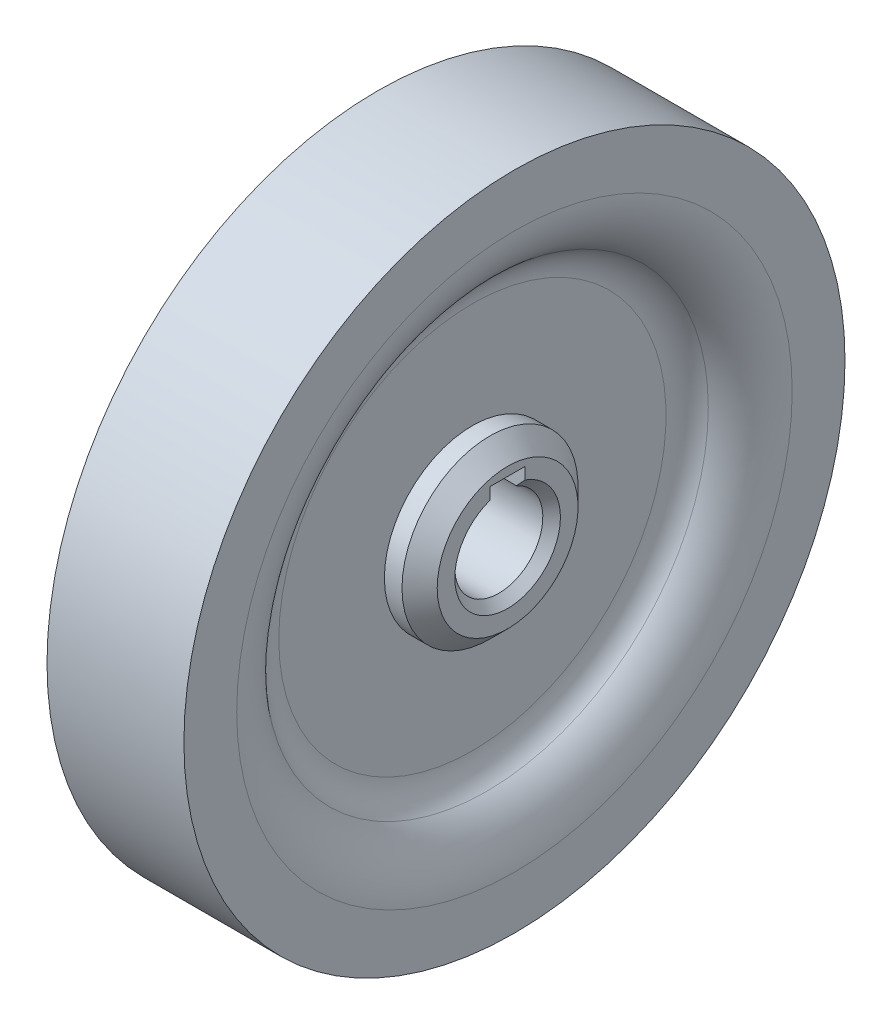
ISO-10303-21;
HEADER;
FILE_DESCRIPTION(('STEP AP214'),'2;1');
FILE_NAME('part.step','',(''),(''),'','','');
FILE_SCHEMA(('AUTOMOTIVE_DESIGN { 1 0 10303 214 1 1 1 1 }'));
ENDSEC;
DATA;
#1=APPLICATION_CONTEXT('core data for automotive mechanical design processes');
#2=APPLICATION_PROTOCOL_DEFINITION('international standard','automotive_design',2000,#1);
#3=PRODUCT_CONTEXT('',#1,'mechanical');
#4=PRODUCT('Part','Part','',(#3));
#5=PRODUCT_RELATED_PRODUCT_CATEGORY('part','',(#4));
#6=PRODUCT_DEFINITION_FORMATION('','',#4);
#7=PRODUCT_DEFINITION_CONTEXT('part definition',#1,'design');
#8=PRODUCT_DEFINITION('design','',#6,#7);
#9=PRODUCT_DEFINITION_SHAPE('','',#8);
#10=(LENGTH_UNIT() NAMED_UNIT(*) SI_UNIT(.MILLI.,.METRE.));
#11=(NAMED_UNIT(*) PLANE_ANGLE_UNIT() SI_UNIT($,.RADIAN.));
#12=(NAMED_UNIT(*) SI_UNIT($,.STERADIAN.) SOLID_ANGLE_UNIT());
#13=UNCERTAINTY_MEASURE_WITH_UNIT(LENGTH_MEASURE(1.E-05),#10,'distance_accuracy_value','');
#14=(GEOMETRIC_REPRESENTATION_CONTEXT(3) GLOBAL_UNCERTAINTY_ASSIGNED_CONTEXT((#13)) GLOBAL_UNIT_ASSIGNED_CONTEXT((#10,
#11,#12)) REPRESENTATION_CONTEXT('',''));
#15=CARTESIAN_POINT('',(0.,0.,0.));
#16=DIRECTION('',(0.,0.,1.));
#17=DIRECTION('',(1.,0.,0.));
#18=AXIS2_PLACEMENT_3D('',#15,#16,#17);
#19=CARTESIAN_POINT('',(-1.77338341008022,0.,0.));
#20=DIRECTION('',(-1.,0.,0.));
#21=DIRECTION('',(0.,0.,1.));
#22=AXIS2_PLACEMENT_3D('',#19,#20,#21);
#23=CYLINDRICAL_SURFACE('',#22,37.555066430944);
#24=CARTESIAN_POINT('',(-7.77753321547199,0.,0.));
#25=DIRECTION('',(-1.,0.,0.));
#26=DIRECTION('',(0.,0.,1.));
#27=AXIS2_PLACEMENT_3D('',#24,#25,#26);
#28=CIRCLE('',#27,37.555066430944);
#29=CARTESIAN_POINT('',(-7.77753321547199,0.,37.555066430944));
#30=VERTEX_POINT('',#29);
#31=EDGE_CURVE('E249',#30,#30,#28,.T.);
#32=ORIENTED_EDGE('',*,*,#31,.F.);
#33=EDGE_LOOP('',(#32));
#34=FACE_BOUND('',#33,.T.);
#35=CARTESIAN_POINT('',(7.77753321547199,0.,0.));
#36=DIRECTION('',(-1.,0.,0.));
#37=DIRECTION('',(0.,0.,1.));
#38=AXIS2_PLACEMENT_3D('',#35,#36,#37);
#39=CIRCLE('',#38,37.555066430944);
#40=CARTESIAN_POINT('',(7.77753321547199,0.,37.555066430944));
#41=VERTEX_POINT('',#40);
#42=EDGE_CURVE('E213',#41,#41,#39,.T.);
#43=ORIENTED_EDGE('',*,*,#42,.T.);
#44=EDGE_LOOP('',(#43));
#45=FACE_BOUND('',#44,.T.);
#46=ADVANCED_FACE('F45',(#34,#45),#23,.T.);
#47=CARTESIAN_POINT('',(7.77753321547199,37.555066430944,0.));
#48=DIRECTION('',(-1.,0.,0.));
#49=DIRECTION('',(0.,0.,1.));
#50=AXIS2_PLACEMENT_3D('',#47,#48,#49);
#51=PLANE('',#50);
#52=ORIENTED_EDGE('',*,*,#42,.F.);
#53=EDGE_LOOP('',(#52));
#54=FACE_BOUND('',#53,.T.);
#55=CARTESIAN_POINT('',(7.77753321547199,0.,0.));
#56=DIRECTION('',(-1.,0.,0.));
#57=DIRECTION('',(0.,0.,1.));
#58=AXIS2_PLACEMENT_3D('',#55,#56,#57);
#59=CIRCLE('',#58,31.555066430944);
#60=CARTESIAN_POINT('',(7.77753321547199,0.,31.555066430944));
#61=VERTEX_POINT('',#60);
#62=EDGE_CURVE('E217',#61,#61,#59,.T.);
#63=ORIENTED_EDGE('',*,*,#62,.T.);
#64=EDGE_LOOP('',(#63));
#65=FACE_BOUND('',#64,.T.);
#66=ADVANCED_FACE('F268',(#54,#65),#51,.F.);
#67=CARTESIAN_POINT('',(-0.166299823207954,0.,0.));
#68=DIRECTION('',(-1.,0.,0.));
#69=DIRECTION('',(0.,0.,1.));
#70=AXIS2_PLACEMENT_3D('',#67,#68,#69);
#71=TOROIDAL_SURFACE('',#70,31.555066430944,7.94383303867995);
#72=ORIENTED_EDGE('',*,*,#62,.F.);
#73=EDGE_LOOP('',(#72));
#74=FACE_BOUND('',#73,.T.);
#75=CARTESIAN_POINT('',(4.60000000000001,0.,0.));
#76=DIRECTION('',(-1.,0.,0.));
#77=DIRECTION('',(0.,0.,1.));
#78=AXIS2_PLACEMENT_3D('',#75,#76,#77);
#79=CIRCLE('',#78,25.2);
#80=CARTESIAN_POINT('',(4.60000000000001,0.,25.2));
#81=VERTEX_POINT('',#80);
#82=EDGE_CURVE('E221',#81,#81,#79,.T.);
#83=ORIENTED_EDGE('',*,*,#82,.T.);
#84=EDGE_LOOP('',(#83));
#85=FACE_BOUND('',#84,.T.);
#86=ADVANCED_FACE('F274',(#74,#85),#71,.T.);
#87=CARTESIAN_POINT('',(7.,0.,0.));
#88=DIRECTION('',(-1.,0.,0.));
#89=DIRECTION('',(0.,0.,1.));
#90=AXIS2_PLACEMENT_3D('',#87,#88,#89);
#91=TOROIDAL_SURFACE('',#90,22.,4.);
#92=ORIENTED_EDGE('',*,*,#82,.F.);
#93=EDGE_LOOP('',(#92));
#94=FACE_BOUND('',#93,.T.);
#95=CARTESIAN_POINT('',(3.,0.,0.));
#96=DIRECTION('',(-1.,0.,0.));
#97=DIRECTION('',(0.,0.,1.));
#98=AXIS2_PLACEMENT_3D('',#95,#96,#97);
#99=CIRCLE('',#98,22.);
#100=CARTESIAN_POINT('',(3.,0.,22.));
#101=VERTEX_POINT('',#100);
#102=EDGE_CURVE('E225',#101,#101,#99,.T.);
#103=ORIENTED_EDGE('',*,*,#102,.T.);
#104=EDGE_LOOP('',(#103));
#105=FACE_BOUND('',#104,.T.);
#106=ADVANCED_FACE('F319',(#94,#105),#91,.F.);
#107=CARTESIAN_POINT('',(3.,22.,0.));
#108=DIRECTION('',(-1.,0.,0.));
#109=DIRECTION('',(0.,0.,1.));
#110=AXIS2_PLACEMENT_3D('',#107,#108,#109);
#111=PLANE('',#110);
#112=ORIENTED_EDGE('',*,*,#102,.F.);
#113=EDGE_LOOP('',(#112));
#114=FACE_BOUND('',#113,.T.);
#115=CARTESIAN_POINT('',(3.,0.,0.));
#116=DIRECTION('',(-1.,0.,0.));
#117=DIRECTION('',(0.,0.,1.));
#118=AXIS2_PLACEMENT_3D('',#115,#116,#117);
#119=CIRCLE('',#118,10.);
#120=CARTESIAN_POINT('',(3.,0.,10.));
#121=VERTEX_POINT('',#120);
#122=EDGE_CURVE('E229',#121,#121,#119,.T.);
#123=ORIENTED_EDGE('',*,*,#122,.T.);
#124=EDGE_LOOP('',(#123));
#125=FACE_BOUND('',#124,.T.);
#126=ADVANCED_FACE('F315',(#114,#125),#111,.F.);
#127=CARTESIAN_POINT('',(-1.77338341008022,0.,0.));
#128=DIRECTION('',(-1.,0.,0.));
#129=DIRECTION('',(0.,0.,1.));
#130=AXIS2_PLACEMENT_3D('',#127,#128,#129);
#131=CYLINDRICAL_SURFACE('',#130,10.);
#132=CARTESIAN_POINT('',(5.,0.,0.));
#133=DIRECTION('',(-1.,0.,0.));
#134=DIRECTION('',(0.,0.,1.));
#135=AXIS2_PLACEMENT_3D('',#132,#133,#134);
#136=CIRCLE('',#135,10.);
#137=CARTESIAN_POINT('',(5.,0.,10.));
#138=VERTEX_POINT('',#137);
#139=EDGE_CURVE('E209',#138,#138,#136,.T.);
#140=ORIENTED_EDGE('',*,*,#139,.T.);
#141=EDGE_LOOP('',(#140));
#142=FACE_BOUND('',#141,.T.);
#143=ORIENTED_EDGE('',*,*,#122,.F.);
#144=EDGE_LOOP('',(#143));
#145=FACE_BOUND('',#144,.T.);
#146=ADVANCED_FACE('F309',(#142,#145),#131,.T.);
#147=CARTESIAN_POINT('',(7.,10.,0.));
#148=DIRECTION('',(-1.,0.,0.));
#149=DIRECTION('',(0.,0.,1.));
#150=AXIS2_PLACEMENT_3D('',#147,#148,#149);
#151=PLANE('',#150);
#152=CARTESIAN_POINT('',(7.,0.,0.));
#153=DIRECTION('',(-1.,0.,0.));
#154=DIRECTION('',(0.,0.,1.));
#155=AXIS2_PLACEMENT_3D('',#152,#153,#154);
#156=CIRCLE('',#155,6.00000000000002);
#157=CARTESIAN_POINT('',(7.,5.6568542494924,-2.));
#158=VERTEX_POINT('',#157);
#159=CARTESIAN_POINT('',(7.,5.6568542494924,2.));
#160=VERTEX_POINT('',#159);
#161=EDGE_CURVE('E192',#158,#160,#156,.T.);
#162=ORIENTED_EDGE('',*,*,#161,.T.);
#163=DIRECTION('',(0.,-1.,0.));
#164=VECTOR('',#163,1.);
#165=CARTESIAN_POINT('',(7.,7.,2.));
#166=LINE('',#165,#164);
#167=CARTESIAN_POINT('',(7.,7.,2.));
#168=VERTEX_POINT('',#167);
#169=EDGE_CURVE('E120',#168,#160,#166,.T.);
#170=ORIENTED_EDGE('',*,*,#169,.F.);
#171=DIRECTION('',(0.,0.,1.));
#172=VECTOR('',#171,1.);
#173=CARTESIAN_POINT('',(7.,7.,2.));
#174=LINE('',#173,#172);
#175=CARTESIAN_POINT('',(7.,7.,-2.));
#176=VERTEX_POINT('',#175);
#177=EDGE_CURVE('E106',#176,#168,#174,.T.);
#178=ORIENTED_EDGE('',*,*,#177,.F.);
#179=DIRECTION('',(0.,1.,0.));
#180=VECTOR('',#179,1.);
#181=CARTESIAN_POINT('',(7.,7.,-2.));
#182=LINE('',#181,#180);
#183=EDGE_CURVE('E112',#158,#176,#182,.T.);
#184=ORIENTED_EDGE('',*,*,#183,.F.);
#185=EDGE_LOOP('',(#162,#170,#178,#184));
#186=FACE_BOUND('',#185,.T.);
#187=CARTESIAN_POINT('',(7.,0.,0.));
#188=DIRECTION('',(-1.,0.,0.));
#189=DIRECTION('',(0.,0.,1.));
#190=AXIS2_PLACEMENT_3D('',#187,#188,#189);
#191=CIRCLE('',#190,7.99999999999999);
#192=CARTESIAN_POINT('',(7.,0.,7.99999999999999));
#193=VERTEX_POINT('',#192);
#194=EDGE_CURVE('E205',#193,#193,#191,.F.);
#195=ORIENTED_EDGE('',*,*,#194,.T.);
#196=EDGE_LOOP('',(#195));
#197=FACE_BOUND('',#196,.T.);
#198=ADVANCED_FACE('F122',(#186,#197),#151,.F.);
#199=CARTESIAN_POINT('',(-7.,10.,0.));
#200=DIRECTION('',(1.,0.,0.));
#201=DIRECTION('',(0.,0.,-1.));
#202=AXIS2_PLACEMENT_3D('',#199,#200,#201);
#203=PLANE('',#202);
#204=DIRECTION('',(0.,0.,1.));
#205=VECTOR('',#204,1.);
#206=CARTESIAN_POINT('',(-7.,7.,0.));
#207=LINE('',#206,#205);
#208=CARTESIAN_POINT('',(-7.,7.,-2.));
#209=VERTEX_POINT('',#208);
#210=CARTESIAN_POINT('',(-7.,7.,2.));
#211=VERTEX_POINT('',#210);
#212=EDGE_CURVE('E11',#209,#211,#207,.T.);
#213=ORIENTED_EDGE('',*,*,#212,.T.);
#214=DIRECTION('',(0.,-1.,0.));
#215=VECTOR('',#214,1.);
#216=CARTESIAN_POINT('',(-7.,10.,2.00000000000001));
#217=LINE('',#216,#215);
#218=CARTESIAN_POINT('',(-7.00000000000002,5.65685424949241,2.));
#219=VERTEX_POINT('',#218);
#220=EDGE_CURVE('E174',#211,#219,#217,.T.);
#221=ORIENTED_EDGE('',*,*,#220,.T.);
#222=CARTESIAN_POINT('',(-7.,0.,0.));
#223=DIRECTION('',(1.,0.,0.));
#224=DIRECTION('',(0.,0.,-1.));
#225=AXIS2_PLACEMENT_3D('',#222,#223,#224);
#226=CIRCLE('',#225,6.00000000000001);
#227=CARTESIAN_POINT('',(-7.,5.65685424949239,-2.));
#228=VERTEX_POINT('',#227);
#229=EDGE_CURVE('E165',#219,#228,#226,.T.);
#230=ORIENTED_EDGE('',*,*,#229,.T.);
#231=DIRECTION('',(0.,1.,0.));
#232=VECTOR('',#231,1.);
#233=CARTESIAN_POINT('',(-7.,10.,-2.));
#234=LINE('',#233,#232);
#235=EDGE_CURVE('E63',#228,#209,#234,.T.);
#236=ORIENTED_EDGE('',*,*,#235,.T.);
#237=EDGE_LOOP('',(#213,#221,#230,#236));
#238=FACE_BOUND('',#237,.T.);
#239=CARTESIAN_POINT('',(-7.,0.,0.));
#240=DIRECTION('',(1.,0.,0.));
#241=DIRECTION('',(0.,0.,-1.));
#242=AXIS2_PLACEMENT_3D('',#239,#240,#241);
#243=CIRCLE('',#242,8.00000000000002);
#244=CARTESIAN_POINT('',(-7.,0.,-8.00000000000002));
#245=VERTEX_POINT('',#244);
#246=EDGE_CURVE('E201',#245,#245,#243,.F.);
#247=ORIENTED_EDGE('',*,*,#246,.T.);
#248=EDGE_LOOP('',(#247));
#249=FACE_BOUND('',#248,.T.);
#250=ADVANCED_FACE('F181',(#238,#249),#203,.F.);
#251=CARTESIAN_POINT('',(-1.77338341008022,0.,0.));
#252=DIRECTION('',(-1.,0.,0.));
#253=DIRECTION('',(0.,0.,1.));
#254=AXIS2_PLACEMENT_3D('',#251,#252,#253);
#255=CYLINDRICAL_SURFACE('',#254,10.);
#256=CARTESIAN_POINT('',(-5.,0.,0.));
#257=DIRECTION('',(1.,0.,0.));
#258=DIRECTION('',(0.,0.,-1.));
#259=AXIS2_PLACEMENT_3D('',#256,#257,#258);
#260=CIRCLE('',#259,10.);
#261=CARTESIAN_POINT('',(-5.,0.,-10.));
#262=VERTEX_POINT('',#261);
#263=EDGE_CURVE('E197',#262,#262,#260,.T.);
#264=ORIENTED_EDGE('',*,*,#263,.T.);
#265=EDGE_LOOP('',(#264));
#266=FACE_BOUND('',#265,.T.);
#267=CARTESIAN_POINT('',(-3.,0.,0.));
#268=DIRECTION('',(-1.,0.,0.));
#269=DIRECTION('',(0.,0.,1.));
#270=AXIS2_PLACEMENT_3D('',#267,#268,#269);
#271=CIRCLE('',#270,10.);
#272=CARTESIAN_POINT('',(-3.,0.,10.));
#273=VERTEX_POINT('',#272);
#274=EDGE_CURVE('E233',#273,#273,#271,.T.);
#275=ORIENTED_EDGE('',*,*,#274,.T.);
#276=EDGE_LOOP('',(#275));
#277=FACE_BOUND('',#276,.T.);
#278=ADVANCED_FACE('F300',(#266,#277),#255,.T.);
#279=CARTESIAN_POINT('',(-3.,22.,0.));
#280=DIRECTION('',(1.,0.,0.));
#281=DIRECTION('',(0.,0.,-1.));
#282=AXIS2_PLACEMENT_3D('',#279,#280,#281);
#283=PLANE('',#282);
#284=ORIENTED_EDGE('',*,*,#274,.F.);
#285=EDGE_LOOP('',(#284));
#286=FACE_BOUND('',#285,.T.);
#287=CARTESIAN_POINT('',(-3.,0.,0.));
#288=DIRECTION('',(-1.,0.,0.));
#289=DIRECTION('',(0.,0.,1.));
#290=AXIS2_PLACEMENT_3D('',#287,#288,#289);
#291=CIRCLE('',#290,22.);
#292=CARTESIAN_POINT('',(-3.,0.,22.));
#293=VERTEX_POINT('',#292);
#294=EDGE_CURVE('E237',#293,#293,#291,.T.);
#295=ORIENTED_EDGE('',*,*,#294,.T.);
#296=EDGE_LOOP('',(#295));
#297=FACE_BOUND('',#296,.T.);
#298=ADVANCED_FACE('F306',(#286,#297),#283,.F.);
#299=CARTESIAN_POINT('',(-7.,0.,0.));
#300=DIRECTION('',(-1.,0.,0.));
#301=DIRECTION('',(0.,0.,1.));
#302=AXIS2_PLACEMENT_3D('',#299,#300,#301);
#303=TOROIDAL_SURFACE('',#302,22.,4.);
#304=ORIENTED_EDGE('',*,*,#294,.F.);
#305=EDGE_LOOP('',(#304));
#306=FACE_BOUND('',#305,.T.);
#307=CARTESIAN_POINT('',(-4.60000000000001,0.,0.));
#308=DIRECTION('',(-1.,0.,0.));
#309=DIRECTION('',(0.,0.,1.));
#310=AXIS2_PLACEMENT_3D('',#307,#308,#309);
#311=CIRCLE('',#310,25.2);
#312=CARTESIAN_POINT('',(-4.60000000000001,0.,25.2));
#313=VERTEX_POINT('',#312);
#314=EDGE_CURVE('E241',#313,#313,#311,.T.);
#315=ORIENTED_EDGE('',*,*,#314,.T.);
#316=EDGE_LOOP('',(#315));
#317=FACE_BOUND('',#316,.T.);
#318=ADVANCED_FACE('F372',(#306,#317),#303,.F.);
#319=CARTESIAN_POINT('',(0.166299823207954,0.,0.));
#320=DIRECTION('',(-1.,0.,0.));
#321=DIRECTION('',(0.,0.,1.));
#322=AXIS2_PLACEMENT_3D('',#319,#320,#321);
#323=TOROIDAL_SURFACE('',#322,31.555066430944,7.94383303867995);
#324=ORIENTED_EDGE('',*,*,#314,.F.);
#325=EDGE_LOOP('',(#324));
#326=FACE_BOUND('',#325,.T.);
#327=CARTESIAN_POINT('',(-7.77753321547199,0.,0.));
#328=DIRECTION('',(-1.,0.,0.));
#329=DIRECTION('',(0.,0.,1.));
#330=AXIS2_PLACEMENT_3D('',#327,#328,#329);
#331=CIRCLE('',#330,31.555066430944);
#332=CARTESIAN_POINT('',(-7.77753321547199,0.,31.555066430944));
#333=VERTEX_POINT('',#332);
#334=EDGE_CURVE('E245',#333,#333,#331,.T.);
#335=ORIENTED_EDGE('',*,*,#334,.T.);
#336=EDGE_LOOP('',(#335));
#337=FACE_BOUND('',#336,.T.);
#338=ADVANCED_FACE('F379',(#326,#337),#323,.T.);
#339=CARTESIAN_POINT('',(-7.77753321547199,37.555066430944,0.));
#340=DIRECTION('',(1.,0.,0.));
#341=DIRECTION('',(0.,0.,-1.));
#342=AXIS2_PLACEMENT_3D('',#339,#340,#341);
#343=PLANE('',#342);
#344=ORIENTED_EDGE('',*,*,#334,.F.);
#345=EDGE_LOOP('',(#344));
#346=FACE_BOUND('',#345,.T.);
#347=ORIENTED_EDGE('',*,*,#31,.T.);
#348=EDGE_LOOP('',(#347));
#349=FACE_BOUND('',#348,.T.);
#350=ADVANCED_FACE('F287',(#346,#349),#343,.F.);
#351=CARTESIAN_POINT('',(5.,0.,0.));
#352=DIRECTION('',(-1.,0.,0.));
#353=DIRECTION('',(0.,0.,1.));
#354=AXIS2_PLACEMENT_3D('',#351,#352,#353);
#355=CONICAL_SURFACE('',#354,10.,0.78539816339745);
#356=ORIENTED_EDGE('',*,*,#194,.F.);
#357=EDGE_LOOP('',(#356));
#358=FACE_BOUND('',#357,.T.);
#359=ORIENTED_EDGE('',*,*,#139,.F.);
#360=EDGE_LOOP('',(#359));
#361=FACE_BOUND('',#360,.T.);
#362=ADVANCED_FACE('F282',(#358,#361),#355,.T.);
#363=CARTESIAN_POINT('',(-7.,0.,0.));
#364=DIRECTION('',(1.,0.,0.));
#365=DIRECTION('',(0.,0.,-1.));
#366=AXIS2_PLACEMENT_3D('',#363,#364,#365);
#367=CONICAL_SURFACE('',#366,8.00000000000002,0.785398163397443);
#368=ORIENTED_EDGE('',*,*,#263,.F.);
#369=EDGE_LOOP('',(#368));
#370=FACE_BOUND('',#369,.T.);
#371=ORIENTED_EDGE('',*,*,#246,.F.);
#372=EDGE_LOOP('',(#371));
#373=FACE_BOUND('',#372,.T.);
#374=ADVANCED_FACE('F266',(#370,#373),#367,.T.);
#375=CARTESIAN_POINT('',(-7.,0.,0.));
#376=DIRECTION('',(-1.,0.,0.));
#377=DIRECTION('',(0.,0.,1.));
#378=AXIS2_PLACEMENT_3D('',#375,#376,#377);
#379=CYLINDRICAL_SURFACE('',#378,5.);
#380=CARTESIAN_POINT('',(-5.99999999999999,0.,0.));
#381=DIRECTION('',(1.,0.,0.));
#382=DIRECTION('',(0.,0.,-1.));
#383=AXIS2_PLACEMENT_3D('',#380,#381,#382);
#384=CIRCLE('',#383,5.);
#385=CARTESIAN_POINT('',(-5.99999999999999,4.58257569495584,-2.));
#386=VERTEX_POINT('',#385);
#387=CARTESIAN_POINT('',(-5.99999999999999,4.58257569495584,2.));
#388=VERTEX_POINT('',#387);
#389=EDGE_CURVE('E188',#386,#388,#384,.F.);
#390=ORIENTED_EDGE('',*,*,#389,.T.);
#391=DIRECTION('',(-1.,0.,0.));
#392=VECTOR('',#391,1.);
#393=CARTESIAN_POINT('',(-7.,4.58257569495584,2.));
#394=LINE('',#393,#392);
#395=CARTESIAN_POINT('',(5.99999999999998,4.58257569495584,2.));
#396=VERTEX_POINT('',#395);
#397=EDGE_CURVE('E143',#388,#396,#394,.F.);
#398=ORIENTED_EDGE('',*,*,#397,.T.);
#399=CARTESIAN_POINT('',(5.99999999999998,0.,0.));
#400=DIRECTION('',(-1.,0.,0.));
#401=DIRECTION('',(0.,0.,1.));
#402=AXIS2_PLACEMENT_3D('',#399,#400,#401);
#403=CIRCLE('',#402,5.);
#404=CARTESIAN_POINT('',(5.99999999999998,4.58257569495584,-2.));
#405=VERTEX_POINT('',#404);
#406=EDGE_CURVE('E185',#396,#405,#403,.F.);
#407=ORIENTED_EDGE('',*,*,#406,.T.);
#408=DIRECTION('',(-1.,0.,0.));
#409=VECTOR('',#408,1.);
#410=CARTESIAN_POINT('',(-7.,4.58257569495584,-2.));
#411=LINE('',#410,#409);
#412=EDGE_CURVE('E129',#405,#386,#411,.T.);
#413=ORIENTED_EDGE('',*,*,#412,.T.);
#414=EDGE_LOOP('',(#390,#398,#407,#413));
#415=FACE_BOUND('',#414,.T.);
#416=ADVANCED_FACE('F259',(#415),#379,.F.);
#417=CARTESIAN_POINT('',(7.,0.,0.));
#418=DIRECTION('',(1.,0.,0.));
#419=DIRECTION('',(0.,0.,-1.));
#420=AXIS2_PLACEMENT_3D('',#417,#418,#419);
#421=CONICAL_SURFACE('',#420,6.00000000000002,0.78539816339745);
#422=CARTESIAN_POINT('',(10.1624776601684,8.94153213230739,2.));
#423=CARTESIAN_POINT('',(9.86391435164426,8.63553536429983,2.));
#424=CARTESIAN_POINT('',(9.5656712848433,8.32922323026492,2.));
#425=CARTESIAN_POINT('',(8.97018529683158,7.71554392307469,2.));
#426=CARTESIAN_POINT('',(8.67294252436475,7.40817660564743,2.));
#427=CARTESIAN_POINT('',(8.08861878557703,6.80110562665531,2.));
#428=CARTESIAN_POINT('',(7.80149595962643,6.50144229078927,2.));
#429=CARTESIAN_POINT('',(7.22929424477133,5.90023071493034,2.));
#430=CARTESIAN_POINT('',(6.94421512464595,5.5986826956302,2.));
#431=CARTESIAN_POINT('',(6.49728843990231,5.12093174419816,2.));
#432=CARTESIAN_POINT('',(6.33437783023149,4.94572401373889,2.));
#433=CARTESIAN_POINT('',(6.00995027704315,4.59393656745478,2.));
#434=CARTESIAN_POINT('',(5.84843370409632,4.41735650918075,2.));
#435=CARTESIAN_POINT('',(5.52403340474509,4.05867690213291,2.));
#436=CARTESIAN_POINT('',(5.36119181599993,3.87653918305989,2.));
#437=CARTESIAN_POINT('',(5.03865340007194,3.50975891201592,2.));
#438=CARTESIAN_POINT('',(4.87895399931276,3.3251186386043,2.));
#439=CARTESIAN_POINT('',(4.64139567209144,3.04340919982797,2.));
#440=CARTESIAN_POINT('',(4.56180824132705,2.94779921414665,2.));
#441=CARTESIAN_POINT('',(4.404202382686,2.75529678833276,2.));
#442=CARTESIAN_POINT('',(4.32618389746334,2.65840439528845,2.));
#443=CARTESIAN_POINT('',(4.17190665390124,2.46264831713408,2.));
#444=CARTESIAN_POINT('',(4.09565536683075,2.36377872284854,2.));
#445=CARTESIAN_POINT('',(3.9459157720668,2.16397809757565,2.));
#446=CARTESIAN_POINT('',(3.87242708815776,2.06304735018948,2.));
#447=CARTESIAN_POINT('',(3.73174997048575,1.86210317909854,2.));
#448=CARTESIAN_POINT('',(3.66443095624058,1.76218179976241,2.));
#449=CARTESIAN_POINT('',(3.53468172938595,1.55907891570378,2.));
#450=CARTESIAN_POINT('',(3.4722548701152,1.45589524166392,2.));
#451=CARTESIAN_POINT('',(3.35487025713995,1.24616640352714,2.));
#452=CARTESIAN_POINT('',(3.29986773131331,1.1396466479669,2.));
#453=CARTESIAN_POINT('',(3.20015631760455,0.921958690283228,2.));
#454=CARTESIAN_POINT('',(3.1554284586904,0.810799510362835,2.));
#455=CARTESIAN_POINT('',(3.09564739626414,0.629169682772104,2.));
#456=CARTESIAN_POINT('',(3.0758869804795,0.560257754550323,2.));
#457=CARTESIAN_POINT('',(3.04269349577663,0.42091763288749,2.));
#458=CARTESIAN_POINT('',(3.02925879755431,0.350489834778889,2.));
#459=CARTESIAN_POINT('',(3.0093358039329,0.206510840975354,2.));
#460=CARTESIAN_POINT('',(3.00306296245473,0.13292864217997,2.));
#461=CARTESIAN_POINT('',(2.99978084304807,0.0222809709856393,2.));
#462=CARTESIAN_POINT('',(2.99971344899458,-0.0147144251784761,2.));
#463=CARTESIAN_POINT('',(3.00162205638964,-0.0886578514925554,2.));
#464=CARTESIAN_POINT('',(3.00359834834347,-0.12560587416089,2.));
#465=CARTESIAN_POINT('',(3.00658889413197,-0.1624776601684,2.));
#466=B_SPLINE_CURVE_WITH_KNOTS('',3,(#422,#423,#424,#425,#426,#427,#428,#429,#430,#431,#432,
#433,#434,#435,#436,#437,#438,#439,#440,#441,#442,#443,#444,#445,#446,#447,#448,#449,#450,#451,
#452,#453,#454,#455,#456,#457,#458,#459,#460,#461,#462,#463,#464,#465),.UNSPECIFIED.,.F.,.F.,(4,
2,2,2,2,2,2,2,2,2,2,2,2,2,2,2,2,2,2,2,2,4),(0.,1.28256556163866,2.56531408622527,
3.81035459007246,5.05525193609061,5.77297803975531,6.49088939487238,7.22382629388467,
7.95613554819477,8.32932415835374,8.70249910334018,9.07703755690044,9.45152481908386,
9.8128739709611,10.1744686824744,10.5337748210856,10.8924121106512,11.1072335264048,
11.3219995806704,11.5430691309877,11.6540056209589,11.7649578824659),.UNSPECIFIED.);
#467=EDGE_CURVE('E71',#160,#396,#466,.T.);
#468=ORIENTED_EDGE('',*,*,#467,.F.);
#469=ORIENTED_EDGE('',*,*,#161,.F.);
#470=CARTESIAN_POINT('',(3.00658889413197,-0.162477660168401,-2.));
#471=CARTESIAN_POINT('',(3.00251539013583,-0.112498481148528,-2.));
#472=CARTESIAN_POINT('',(3.00033668660352,-0.062367061415583,-2.));
#473=CARTESIAN_POINT('',(2.99973826971256,0.0378782104132634,-2.));
#474=CARTESIAN_POINT('',(3.00131552965636,0.0879920441289992,-2.));
#475=CARTESIAN_POINT('',(3.00813266314332,0.187099355145824,-2.));
#476=CARTESIAN_POINT('',(3.01330889225491,0.236097247413735,-2.));
#477=CARTESIAN_POINT('',(3.02705920730471,0.333617049996812,-2.));
#478=CARTESIAN_POINT('',(3.03563407235345,0.382138848555777,-2.));
#479=CARTESIAN_POINT('',(3.06256187957009,0.510138972194041,-2.));
#480=CARTESIAN_POINT('',(3.08363943614134,0.589050081254606,-2.));
#481=CARTESIAN_POINT('',(3.13284510136286,0.744644742860485,-2.));
#482=CARTESIAN_POINT('',(3.16097857393407,0.821326550971189,-2.));
#483=CARTESIAN_POINT('',(3.22310651286979,0.973165736512864,-2.));
#484=CARTESIAN_POINT('',(3.25715808300434,1.04829944131261,-2.));
#485=CARTESIAN_POINT('',(3.32962299070121,1.19637439650531,-2.));
#486=CARTESIAN_POINT('',(3.36803481562065,1.26931639619739,-2.));
#487=CARTESIAN_POINT('',(3.44674193664563,1.41062392735597,-2.));
#488=CARTESIAN_POINT('',(3.48691388028734,1.4790587397437,-2.));
#489=CARTESIAN_POINT('',(3.5697279162923,1.6144225123533,-2.));
#490=CARTESIAN_POINT('',(3.61237039991549,1.6813512317118,-2.));
#491=CARTESIAN_POINT('',(3.74326881211618,1.88030977210975,-2.));
#492=CARTESIAN_POINT('',(3.83444096406264,2.01041712011472,-2.));
#493=CARTESIAN_POINT('',(4.02203511342909,2.26723548887346,-2.));
#494=CARTESIAN_POINT('',(4.11846981445792,2.39393707981038,-2.));
#495=CARTESIAN_POINT('',(4.31481651408573,2.64463146636892,-2.));
#496=CARTESIAN_POINT('',(4.41472895263615,2.76862391601726,-2.));
#497=CARTESIAN_POINT('',(4.61756500953009,3.01524662147207,-2.));
#498=CARTESIAN_POINT('',(4.72050207910162,3.13786575921159,-2.));
#499=CARTESIAN_POINT('',(4.92821206883095,3.38155354901471,-2.));
#500=CARTESIAN_POINT('',(5.03298514784846,3.50262206532726,-2.));
#501=CARTESIAN_POINT('',(5.24372844178069,3.74334149138621,-2.));
#502=CARTESIAN_POINT('',(5.34969627987217,3.86299448624843,-2.));
#503=CARTESIAN_POINT('',(5.56269763191079,4.10134887895192,-2.));
#504=CARTESIAN_POINT('',(5.66973115653871,4.2200502672342,-2.));
#505=CARTESIAN_POINT('',(5.95734936523766,4.53676588758942,-2.));
#506=CARTESIAN_POINT('',(6.13869079348944,4.73409250092108,-2.));
#507=CARTESIAN_POINT('',(6.50300817326232,5.12723382463011,-2.));
#508=CARTESIAN_POINT('',(6.68598415551802,5.32304850644895,-2.));
#509=CARTESIAN_POINT('',(7.05324970770017,5.71369067199312,-2.));
#510=CARTESIAN_POINT('',(7.23754008222048,5.90851739862664,-2.));
#511=CARTESIAN_POINT('',(7.60701292404809,6.29732308578616,-2.));
#512=CARTESIAN_POINT('',(7.79219539320627,6.49130204455167,-2.));
#513=CARTESIAN_POINT('',(8.15886523698399,6.87402977243969,-2.));
#514=CARTESIAN_POINT('',(8.3403366080481,7.0627938821664,-2.));
#515=CARTESIAN_POINT('',(8.70379638909382,7.43982442059995,-2.));
#516=CARTESIAN_POINT('',(8.88578480041692,7.6280908480131,-2.));
#517=CARTESIAN_POINT('',(9.25003198451706,8.00407417509303,-2.));
#518=CARTESIAN_POINT('',(9.43229043098612,8.19179139100203,-2.));
#519=CARTESIAN_POINT('',(9.79714712214683,8.56689347380267,-2.));
#520=CARTESIAN_POINT('',(9.9797453650888,8.754278342396,-2.));
#521=CARTESIAN_POINT('',(10.1624776601684,8.9415321323074,-2.));
#522=B_SPLINE_CURVE_WITH_KNOTS('',3,(#470,#471,#472,#473,#474,#475,#476,#477,#478,#479,#480,
#481,#482,#483,#484,#485,#486,#487,#488,#489,#490,#491,#492,#493,#494,#495,#496,#497,#498,#499,
#500,#501,#502,#503,#504,#505,#506,#507,#508,#509,#510,#511,#512,#513,#514,#515,#516,#517,#518,
#519,#520,#521),.UNSPECIFIED.,.F.,.F.,(4,2,2,2,2,2,2,2,2,2,2,2,2,2,2,2,2,2,2,2,2,2,2,2,2,4),(0.,
0.15039619761216,0.300671241292719,0.44835424206514,0.596071117602512,0.840663249073094,
1.08544188656033,1.33272878045652,1.57993014721314,1.81792876772038,2.05596518370023,
2.53236596781094,3.00997255167528,3.48763977636587,3.96791226283958,4.44822651184038,
4.92771221924483,5.40720273711385,6.21117944567631,7.01517130340852,7.81970682872786,
8.6242440239805,9.4097832148152,10.1953244456315,10.9802463055073,11.7651641347567),.UNSPECIFIED.);
#523=EDGE_CURVE('E115',#405,#158,#522,.T.);
#524=ORIENTED_EDGE('',*,*,#523,.F.);
#525=ORIENTED_EDGE('',*,*,#406,.F.);
#526=EDGE_LOOP('',(#468,#469,#524,#525));
#527=FACE_BOUND('',#526,.T.);
#528=ADVANCED_FACE('F146',(#527),#421,.F.);
#529=CARTESIAN_POINT('',(-5.99999999999999,0.,0.));
#530=DIRECTION('',(-1.,0.,0.));
#531=DIRECTION('',(0.,0.,1.));
#532=AXIS2_PLACEMENT_3D('',#529,#530,#531);
#533=CONICAL_SURFACE('',#532,5.,0.785398163397447);
#534=CARTESIAN_POINT('',(-3.00658889413196,-0.162477660168385,2.));
#535=CARTESIAN_POINT('',(-3.00251539013581,-0.112498481148511,2.));
#536=CARTESIAN_POINT('',(-3.00033668660351,-0.062367061415566,2.));
#537=CARTESIAN_POINT('',(-2.99973826971255,0.0378782104132805,2.));
#538=CARTESIAN_POINT('',(-3.00131552965635,0.0879920441290163,2.));
#539=CARTESIAN_POINT('',(-3.00813266314331,0.187099355145842,2.));
#540=CARTESIAN_POINT('',(-3.0133088922549,0.236097247413752,2.));
#541=CARTESIAN_POINT('',(-3.0270592073047,0.333617049996829,2.));
#542=CARTESIAN_POINT('',(-3.03563407235344,0.382138848555794,2.));
#543=CARTESIAN_POINT('',(-3.06256187957008,0.510138972194058,2.));
#544=CARTESIAN_POINT('',(-3.08363943614134,0.589050081254624,2.));
#545=CARTESIAN_POINT('',(-3.13284510136286,0.744644742860504,2.));
#546=CARTESIAN_POINT('',(-3.16097857393406,0.821326550971209,2.));
#547=CARTESIAN_POINT('',(-3.22310651286979,0.973165736512884,2.));
#548=CARTESIAN_POINT('',(-3.25715808300434,1.04829944131264,2.));
#549=CARTESIAN_POINT('',(-3.32962299070121,1.19637439650534,2.));
#550=CARTESIAN_POINT('',(-3.36803481562065,1.26931639619742,2.));
#551=CARTESIAN_POINT('',(-3.44674193664564,1.410623927356,2.));
#552=CARTESIAN_POINT('',(-3.48691388028734,1.47905873974373,2.));
#553=CARTESIAN_POINT('',(-3.56972791629231,1.61442251235332,2.));
#554=CARTESIAN_POINT('',(-3.6123703999155,1.68135123171183,2.));
#555=CARTESIAN_POINT('',(-3.74326881211619,1.88030977210979,2.));
#556=CARTESIAN_POINT('',(-3.83444096406266,2.01041712011476,2.));
#557=CARTESIAN_POINT('',(-4.02203511342912,2.2672354888735,2.));
#558=CARTESIAN_POINT('',(-4.11846981445795,2.39393707981043,2.));
#559=CARTESIAN_POINT('',(-4.31481651408577,2.64463146636898,2.));
#560=CARTESIAN_POINT('',(-4.41472895263619,2.76862391601732,2.));
#561=CARTESIAN_POINT('',(-4.61756500953014,3.01524662147213,2.));
#562=CARTESIAN_POINT('',(-4.72050207910167,3.13786575921166,2.));
#563=CARTESIAN_POINT('',(-4.92821206883101,3.38155354901478,2.));
#564=CARTESIAN_POINT('',(-5.03298514784852,3.50262206532734,2.));
#565=CARTESIAN_POINT('',(-5.24372844178076,3.74334149138629,2.));
#566=CARTESIAN_POINT('',(-5.34969627987225,3.86299448624851,2.));
#567=CARTESIAN_POINT('',(-5.56269763191088,4.101348878952,2.));
#568=CARTESIAN_POINT('',(-5.6697311565388,4.22005026723429,2.));
#569=CARTESIAN_POINT('',(-5.95734936523775,4.5367658875895,2.));
#570=CARTESIAN_POINT('',(-6.13869079348953,4.73409250092116,2.));
#571=CARTESIAN_POINT('',(-6.50300817326239,5.12723382463018,2.));
#572=CARTESIAN_POINT('',(-6.68598415551809,5.32304850644901,2.));
#573=CARTESIAN_POINT('',(-7.05324970770022,5.71369067199317,2.));
#574=CARTESIAN_POINT('',(-7.23754008222053,5.90851739862668,2.));
#575=CARTESIAN_POINT('',(-7.60701292404814,6.29732308578619,2.));
#576=CARTESIAN_POINT('',(-7.79219539320631,6.49130204455169,2.));
#577=CARTESIAN_POINT('',(-8.15886523698402,6.8740297724397,2.));
#578=CARTESIAN_POINT('',(-8.34033660804812,7.0627938821664,2.));
#579=CARTESIAN_POINT('',(-8.70379638909384,7.43982442059994,2.));
#580=CARTESIAN_POINT('',(-8.88578480041693,7.62809084801308,2.));
#581=CARTESIAN_POINT('',(-9.25003198451706,8.004074175093,2.));
#582=CARTESIAN_POINT('',(-9.43229043098612,8.19179139100199,2.));
#583=CARTESIAN_POINT('',(-9.79714712214682,8.56689347380262,2.));
#584=CARTESIAN_POINT('',(-9.97974536508878,8.75427834239595,2.));
#585=CARTESIAN_POINT('',(-10.1624776601684,8.94153213230734,2.));
#586=B_SPLINE_CURVE_WITH_KNOTS('',3,(#534,#535,#536,#537,#538,#539,#540,#541,#542,#543,#544,
#545,#546,#547,#548,#549,#550,#551,#552,#553,#554,#555,#556,#557,#558,#559,#560,#561,#562,#563,
#564,#565,#566,#567,#568,#569,#570,#571,#572,#573,#574,#575,#576,#577,#578,#579,#580,#581,#582,
#583,#584,#585),.UNSPECIFIED.,.F.,.F.,(4,2,2,2,2,2,2,2,2,2,2,2,2,2,2,2,2,2,2,2,2,2,2,2,2,4),(0.,
0.15039619761216,0.300671241292719,0.44835424206514,0.596071117602512,0.840663249073097,
1.08544188656033,1.33272878045653,1.57993014721315,1.81792876772039,2.05596518370025,
2.53236596781098,3.00997255167534,3.48763977636593,3.96791226283966,4.44822651184047,
4.92771221924494,5.40720273711397,6.21117944567641,7.01517130340859,7.81970682872791,
8.62424402398052,9.4097832148152,10.1953244456315,10.9802463055072,11.7651641347567),.UNSPECIFIED.);
#587=EDGE_CURVE('E56',#388,#219,#586,.T.);
#588=ORIENTED_EDGE('',*,*,#587,.F.);
#589=ORIENTED_EDGE('',*,*,#389,.F.);
#590=CARTESIAN_POINT('',(-10.1624776601684,8.94153213230734,-2.));
#591=CARTESIAN_POINT('',(-9.86391435164424,8.63553536429978,-2.));
#592=CARTESIAN_POINT('',(-9.56567128484328,8.32922323026487,-2.));
#593=CARTESIAN_POINT('',(-8.97018529683156,7.71554392307464,-2.));
#594=CARTESIAN_POINT('',(-8.67294252436474,7.40817660564739,-2.));
#595=CARTESIAN_POINT('',(-8.08861878557702,6.80110562665527,-2.));
#596=CARTESIAN_POINT('',(-7.80149595962642,6.50144229078924,-2.));
#597=CARTESIAN_POINT('',(-7.22929424477132,5.90023071493031,-2.));
#598=CARTESIAN_POINT('',(-6.94421512464594,5.59868269563017,-2.));
#599=CARTESIAN_POINT('',(-6.4972884399023,5.12093174419813,-2.));
#600=CARTESIAN_POINT('',(-6.33437783023148,4.94572401373887,-2.));
#601=CARTESIAN_POINT('',(-6.00995027704314,4.59393656745476,-2.));
#602=CARTESIAN_POINT('',(-5.84843370409631,4.41735650918073,-2.));
#603=CARTESIAN_POINT('',(-5.52403340474507,4.05867690213289,-2.));
#604=CARTESIAN_POINT('',(-5.36119181599991,3.87653918305988,-2.));
#605=CARTESIAN_POINT('',(-5.03865340007192,3.50975891201591,-2.));
#606=CARTESIAN_POINT('',(-4.87895399931275,3.32511863860429,-2.));
#607=CARTESIAN_POINT('',(-4.64139567209143,3.04340919982796,-2.));
#608=CARTESIAN_POINT('',(-4.56180824132703,2.94779921414664,-2.));
#609=CARTESIAN_POINT('',(-4.40420238268598,2.75529678833275,-2.));
#610=CARTESIAN_POINT('',(-4.32618389746333,2.65840439528844,-2.));
#611=CARTESIAN_POINT('',(-4.17190665390123,2.46264831713407,-2.));
#612=CARTESIAN_POINT('',(-4.09565536683073,2.36377872284853,-2.));
#613=CARTESIAN_POINT('',(-3.94591577206678,2.16397809757564,-2.));
#614=CARTESIAN_POINT('',(-3.87242708815774,2.06304735018947,-2.));
#615=CARTESIAN_POINT('',(-3.73174997048573,1.86210317909854,-2.));
#616=CARTESIAN_POINT('',(-3.66443095624056,1.7621817997624,-2.));
#617=CARTESIAN_POINT('',(-3.53468172938594,1.55907891570377,-2.));
#618=CARTESIAN_POINT('',(-3.47225487011519,1.45589524166391,-2.));
#619=CARTESIAN_POINT('',(-3.35487025713994,1.24616640352713,-2.));
#620=CARTESIAN_POINT('',(-3.2998677313133,1.13964664796689,-2.));
#621=CARTESIAN_POINT('',(-3.20015631760454,0.921958690283224,-2.));
#622=CARTESIAN_POINT('',(-3.15542845869038,0.810799510362831,-2.));
#623=CARTESIAN_POINT('',(-3.09564739626412,0.629169682772101,-2.));
#624=CARTESIAN_POINT('',(-3.07588698047949,0.560257754550321,-2.));
#625=CARTESIAN_POINT('',(-3.04269349577662,0.420917632887491,-2.));
#626=CARTESIAN_POINT('',(-3.02925879755429,0.350489834778893,-2.));
#627=CARTESIAN_POINT('',(-3.00933580393288,0.20651084097536,-2.));
#628=CARTESIAN_POINT('',(-3.00306296245472,0.132928642179978,-2.));
#629=CARTESIAN_POINT('',(-2.99978084304806,0.0222809709856486,-2.));
#630=CARTESIAN_POINT('',(-2.99971344899456,-0.0147144251784662,-2.));
#631=CARTESIAN_POINT('',(-3.00162205638962,-0.0886578514925435,-2.));
#632=CARTESIAN_POINT('',(-3.00359834834346,-0.125605874160877,-2.));
#633=CARTESIAN_POINT('',(-3.00658889413196,-0.162477660168386,-2.));
#634=B_SPLINE_CURVE_WITH_KNOTS('',3,(#590,#591,#592,#593,#594,#595,#596,#597,#598,#599,#600,
#601,#602,#603,#604,#605,#606,#607,#608,#609,#610,#611,#612,#613,#614,#615,#616,#617,#618,#619,
#620,#621,#622,#623,#624,#625,#626,#627,#628,#629,#630,#631,#632,#633),.UNSPECIFIED.,.F.,.F.,(4,
2,2,2,2,2,2,2,2,2,2,2,2,2,2,2,2,2,2,2,2,4),(0.,1.28256556163866,2.56531408622526,
3.81035459007245,5.05525193609059,5.77297803975529,6.49088939487236,7.22382629388464,
7.95613554819474,8.32932415835371,8.70249910334015,9.07703755690041,9.45152481908382,
9.81287397096106,10.1744686824744,10.5337748210856,10.8924121106512,11.1072335264047,
11.3219995806704,11.5430691309877,11.6540056209589,11.7649578824658),.UNSPECIFIED.);
#635=EDGE_CURVE('E158',#228,#386,#634,.T.);
#636=ORIENTED_EDGE('',*,*,#635,.F.);
#637=ORIENTED_EDGE('',*,*,#229,.F.);
#638=EDGE_LOOP('',(#588,#589,#636,#637));
#639=FACE_BOUND('',#638,.T.);
#640=ADVANCED_FACE('F48',(#639),#533,.F.);
#641=CARTESIAN_POINT('',(-7.77753321547199,7.,2.));
#642=DIRECTION('',(0.,1.,0.));
#643=DIRECTION('',(0.,0.,1.));
#644=AXIS2_PLACEMENT_3D('',#641,#642,#643);
#645=PLANE('',#644);
#646=DIRECTION('',(1.,0.,0.));
#647=VECTOR('',#646,1.);
#648=CARTESIAN_POINT('',(-7.77753321547199,7.,-2.));
#649=LINE('',#648,#647);
#650=EDGE_CURVE('E101',#209,#176,#649,.T.);
#651=ORIENTED_EDGE('',*,*,#650,.T.);
#652=ORIENTED_EDGE('',*,*,#177,.T.);
#653=DIRECTION('',(1.,0.,0.));
#654=VECTOR('',#653,1.);
#655=CARTESIAN_POINT('',(-7.77753321547199,7.,2.));
#656=LINE('',#655,#654);
#657=EDGE_CURVE('E109',#211,#168,#656,.T.);
#658=ORIENTED_EDGE('',*,*,#657,.F.);
#659=ORIENTED_EDGE('',*,*,#212,.F.);
#660=EDGE_LOOP('',(#651,#652,#658,#659));
#661=FACE_BOUND('',#660,.T.);
#662=ADVANCED_FACE('F103',(#661),#645,.F.);
#663=CARTESIAN_POINT('',(-7.77753321547199,7.,2.));
#664=DIRECTION('',(0.,0.,1.));
#665=DIRECTION('',(0.,-1.,0.));
#666=AXIS2_PLACEMENT_3D('',#663,#664,#665);
#667=PLANE('',#666);
#668=ORIENTED_EDGE('',*,*,#467,.T.);
#669=ORIENTED_EDGE('',*,*,#397,.F.);
#670=ORIENTED_EDGE('',*,*,#587,.T.);
#671=ORIENTED_EDGE('',*,*,#220,.F.);
#672=ORIENTED_EDGE('',*,*,#657,.T.);
#673=ORIENTED_EDGE('',*,*,#169,.T.);
#674=EDGE_LOOP('',(#668,#669,#670,#671,#672,#673));
#675=FACE_BOUND('',#674,.T.);
#676=ADVANCED_FACE('F153',(#675),#667,.F.);
#677=CARTESIAN_POINT('',(-7.77753321547199,7.,-2.));
#678=DIRECTION('',(0.,0.,-1.));
#679=DIRECTION('',(0.,1.,0.));
#680=AXIS2_PLACEMENT_3D('',#677,#678,#679);
#681=PLANE('',#680);
#682=ORIENTED_EDGE('',*,*,#523,.T.);
#683=ORIENTED_EDGE('',*,*,#183,.T.);
#684=ORIENTED_EDGE('',*,*,#650,.F.);
#685=ORIENTED_EDGE('',*,*,#235,.F.);
#686=ORIENTED_EDGE('',*,*,#635,.T.);
#687=ORIENTED_EDGE('',*,*,#412,.F.);
#688=EDGE_LOOP('',(#682,#683,#684,#685,#686,#687));
#689=FACE_BOUND('',#688,.T.);
#690=ADVANCED_FACE('F113',(#689),#681,.F.);
#691=CLOSED_SHELL('',(#46,#66,#86,#106,#126,#146,#198,#250,#278,#298,#318,#338,#350,#362,#374,
#416,#528,#640,#662,#676,#690));
#692=MANIFOLD_SOLID_BREP('B2',#691);
#693=ADVANCED_BREP_SHAPE_REPRESENTATION('',(#18,#692),#14);
#694=SHAPE_DEFINITION_REPRESENTATION(#9,#693);
ENDSEC;
END-ISO-10303-21;
